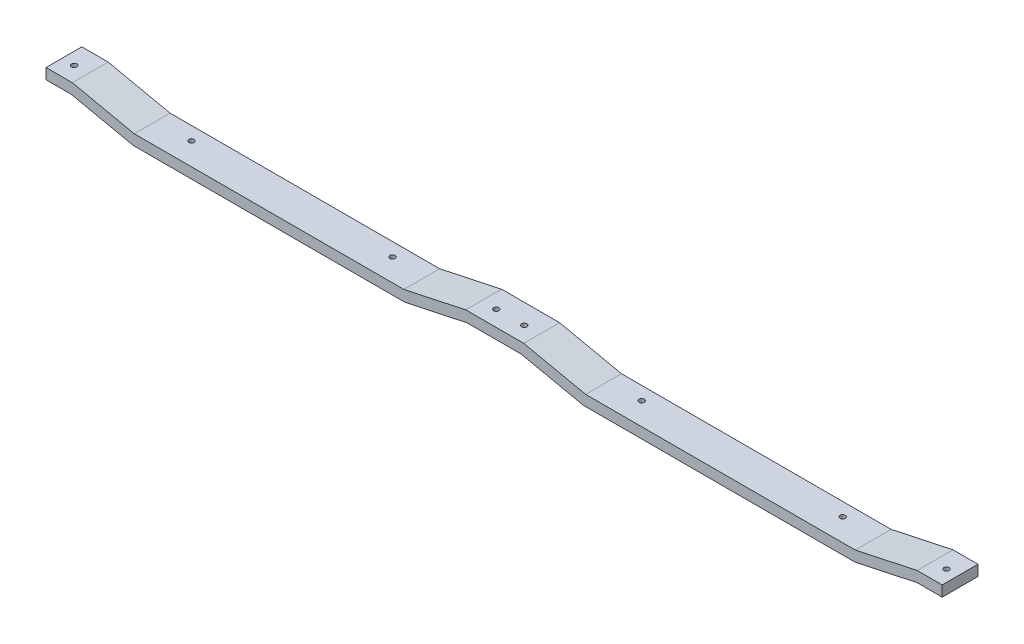
ISO-10303-21;
HEADER;
FILE_DESCRIPTION(('STEP AP214'),'2;1');
FILE_NAME('part.step','',(''),(''),'','','');
FILE_SCHEMA(('AUTOMOTIVE_DESIGN { 1 0 10303 214 1 1 1 1 }'));
ENDSEC;
DATA;
#1=APPLICATION_CONTEXT('core data for automotive mechanical design processes');
#2=APPLICATION_PROTOCOL_DEFINITION('international standard','automotive_design',2000,#1);
#3=PRODUCT_CONTEXT('',#1,'mechanical');
#4=PRODUCT('Part','Part','',(#3));
#5=PRODUCT_RELATED_PRODUCT_CATEGORY('part','',(#4));
#6=PRODUCT_DEFINITION_FORMATION('','',#4);
#7=PRODUCT_DEFINITION_CONTEXT('part definition',#1,'design');
#8=PRODUCT_DEFINITION('design','',#6,#7);
#9=PRODUCT_DEFINITION_SHAPE('','',#8);
#10=(LENGTH_UNIT() NAMED_UNIT(*) SI_UNIT(.MILLI.,.METRE.));
#11=(NAMED_UNIT(*) PLANE_ANGLE_UNIT() SI_UNIT($,.RADIAN.));
#12=(NAMED_UNIT(*) SI_UNIT($,.STERADIAN.) SOLID_ANGLE_UNIT());
#13=UNCERTAINTY_MEASURE_WITH_UNIT(LENGTH_MEASURE(1.E-05),#10,'distance_accuracy_value','');
#14=(GEOMETRIC_REPRESENTATION_CONTEXT(3) GLOBAL_UNCERTAINTY_ASSIGNED_CONTEXT((#13)) GLOBAL_UNIT_ASSIGNED_CONTEXT((#10,
#11,#12)) REPRESENTATION_CONTEXT('',''));
#15=CARTESIAN_POINT('',(0.,0.,0.));
#16=DIRECTION('',(0.,0.,1.));
#17=DIRECTION('',(1.,0.,0.));
#18=AXIS2_PLACEMENT_3D('',#15,#16,#17);
#19=CARTESIAN_POINT('',(-42.05,2.25,6.75));
#20=DIRECTION('',(1.,0.,0.));
#21=DIRECTION('',(0.,0.,-1.));
#22=AXIS2_PLACEMENT_3D('',#19,#20,#21);
#23=PLANE('',#22);
#24=DIRECTION('',(0.,-1.,0.));
#25=VECTOR('',#24,1.);
#26=CARTESIAN_POINT('',(-42.05,2.25,0.));
#27=LINE('',#26,#25);
#28=CARTESIAN_POINT('',(-42.05,2.25,0.));
#29=VERTEX_POINT('',#28);
#30=CARTESIAN_POINT('',(-42.05,0.25,0.));
#31=VERTEX_POINT('',#30);
#32=EDGE_CURVE('E202',#29,#31,#27,.T.);
#33=ORIENTED_EDGE('',*,*,#32,.T.);
#34=DIRECTION('',(0.,0.,-1.));
#35=VECTOR('',#34,1.);
#36=CARTESIAN_POINT('',(-42.05,0.25,6.75));
#37=LINE('',#36,#35);
#38=CARTESIAN_POINT('',(-42.05,0.25,6.75));
#39=VERTEX_POINT('',#38);
#40=EDGE_CURVE('E11',#39,#31,#37,.T.);
#41=ORIENTED_EDGE('',*,*,#40,.F.);
#42=DIRECTION('',(0.,-1.,0.));
#43=VECTOR('',#42,1.);
#44=CARTESIAN_POINT('',(-42.05,2.25,6.75));
#45=LINE('',#44,#43);
#46=CARTESIAN_POINT('',(-42.05,2.25,6.75));
#47=VERTEX_POINT('',#46);
#48=EDGE_CURVE('E252',#47,#39,#45,.T.);
#49=ORIENTED_EDGE('',*,*,#48,.F.);
#50=DIRECTION('',(0.,0.,-1.));
#51=VECTOR('',#50,1.);
#52=CARTESIAN_POINT('',(-42.05,2.25,6.75));
#53=LINE('',#52,#51);
#54=EDGE_CURVE('E198',#47,#29,#53,.T.);
#55=ORIENTED_EDGE('',*,*,#54,.T.);
#56=EDGE_LOOP('',(#33,#41,#49,#55));
#57=FACE_BOUND('',#56,.T.);
#58=ADVANCED_FACE('F33',(#57),#23,.F.);
#59=CARTESIAN_POINT('',(-42.05,0.25,6.75));
#60=DIRECTION('',(0.,1.,0.));
#61=DIRECTION('',(0.,0.,1.));
#62=AXIS2_PLACEMENT_3D('',#59,#60,#61);
#63=PLANE('',#62);
#64=CARTESIAN_POINT('',(-39.736857800849,0.25,3.7604860852329));
#65=DIRECTION('',(0.,1.,0.));
#66=DIRECTION('',(0.,0.,1.));
#67=AXIS2_PLACEMENT_3D('',#64,#65,#66);
#68=CIRCLE('',#67,0.499999999999999);
#69=CARTESIAN_POINT('',(-39.736857800849,0.25,4.2604860852329));
#70=VERTEX_POINT('',#69);
#71=EDGE_CURVE('E324',#70,#70,#68,.T.);
#72=ORIENTED_EDGE('',*,*,#71,.T.);
#73=EDGE_LOOP('',(#72));
#74=FACE_BOUND('',#73,.T.);
#75=DIRECTION('',(1.,0.,0.));
#76=VECTOR('',#75,1.);
#77=CARTESIAN_POINT('',(-42.05,0.25,0.));
#78=LINE('',#77,#76);
#79=CARTESIAN_POINT('',(-37.2967347571378,0.25,0.));
#80=VERTEX_POINT('',#79);
#81=EDGE_CURVE('E205',#31,#80,#78,.T.);
#82=ORIENTED_EDGE('',*,*,#81,.T.);
#83=DIRECTION('',(0.,0.,-1.));
#84=VECTOR('',#83,1.);
#85=CARTESIAN_POINT('',(-37.2967347571378,0.25,6.75));
#86=LINE('',#85,#84);
#87=CARTESIAN_POINT('',(-37.2967347571378,0.25,6.75));
#88=VERTEX_POINT('',#87);
#89=EDGE_CURVE('E42',#88,#80,#86,.T.);
#90=ORIENTED_EDGE('',*,*,#89,.F.);
#91=DIRECTION('',(1.,0.,0.));
#92=VECTOR('',#91,1.);
#93=CARTESIAN_POINT('',(-42.05,0.25,6.75));
#94=LINE('',#93,#92);
#95=EDGE_CURVE('E130',#39,#88,#94,.T.);
#96=ORIENTED_EDGE('',*,*,#95,.F.);
#97=ORIENTED_EDGE('',*,*,#40,.T.);
#98=EDGE_LOOP('',(#82,#90,#96,#97));
#99=FACE_BOUND('',#98,.T.);
#100=ADVANCED_FACE('F394',(#74,#99),#63,.F.);
#101=CARTESIAN_POINT('',(-37.2967347571378,0.25,6.75));
#102=DIRECTION('',(0.209363370555913,0.977837910427627,0.));
#103=DIRECTION('',(-0.977837910427627,0.209363370555913,0.));
#104=AXIS2_PLACEMENT_3D('',#101,#102,#103);
#105=PLANE('',#104);
#106=DIRECTION('',(0.977837910427627,-0.209363370555913,0.));
#107=VECTOR('',#106,1.);
#108=CARTESIAN_POINT('',(-37.2967347571378,0.25,0.));
#109=LINE('',#108,#107);
#110=CARTESIAN_POINT('',(-25.62040966943,-2.25,0.));
#111=VERTEX_POINT('',#110);
#112=EDGE_CURVE('E208',#80,#111,#109,.T.);
#113=ORIENTED_EDGE('',*,*,#112,.T.);
#114=DIRECTION('',(0.,0.,-1.));
#115=VECTOR('',#114,1.);
#116=CARTESIAN_POINT('',(-25.62040966943,-2.25,6.75));
#117=LINE('',#116,#115);
#118=CARTESIAN_POINT('',(-25.62040966943,-2.25,6.75));
#119=VERTEX_POINT('',#118);
#120=EDGE_CURVE('E285',#119,#111,#117,.T.);
#121=ORIENTED_EDGE('',*,*,#120,.F.);
#122=DIRECTION('',(0.977837910427627,-0.209363370555913,0.));
#123=VECTOR('',#122,1.);
#124=CARTESIAN_POINT('',(-37.2967347571378,0.25,6.75));
#125=LINE('',#124,#123);
#126=EDGE_CURVE('E334',#88,#119,#125,.T.);
#127=ORIENTED_EDGE('',*,*,#126,.F.);
#128=ORIENTED_EDGE('',*,*,#89,.T.);
#129=EDGE_LOOP('',(#113,#121,#127,#128));
#130=FACE_BOUND('',#129,.T.);
#131=ADVANCED_FACE('F398',(#130),#105,.F.);
#132=CARTESIAN_POINT('',(-25.62040966943,-2.25,6.75));
#133=DIRECTION('',(0.,1.,0.));
#134=DIRECTION('',(0.,0.,1.));
#135=AXIS2_PLACEMENT_3D('',#132,#133,#134);
#136=PLANE('',#135);
#137=CARTESIAN_POINT('',(-18.8564316077113,-2.25,2.51469630167856));
#138=DIRECTION('',(0.,1.,0.));
#139=DIRECTION('',(0.,0.,1.));
#140=AXIS2_PLACEMENT_3D('',#137,#138,#139);
#141=CIRCLE('',#140,0.499999999999999);
#142=CARTESIAN_POINT('',(-18.8564316077113,-2.25,3.01469630167856));
#143=VERTEX_POINT('',#142);
#144=EDGE_CURVE('E300',#143,#143,#141,.T.);
#145=ORIENTED_EDGE('',*,*,#144,.T.);
#146=EDGE_LOOP('',(#145));
#147=FACE_BOUND('',#146,.T.);
#148=CARTESIAN_POINT('',(19.0389710433223,-2.25,2.51469630167856));
#149=DIRECTION('',(0.,1.,0.));
#150=DIRECTION('',(0.,0.,1.));
#151=AXIS2_PLACEMENT_3D('',#148,#149,#150);
#152=CIRCLE('',#151,0.499999999999999);
#153=CARTESIAN_POINT('',(19.0389710433223,-2.25,3.01469630167856));
#154=VERTEX_POINT('',#153);
#155=EDGE_CURVE('E294',#154,#154,#152,.T.);
#156=ORIENTED_EDGE('',*,*,#155,.T.);
#157=EDGE_LOOP('',(#156));
#158=FACE_BOUND('',#157,.T.);
#159=DIRECTION('',(1.,0.,0.));
#160=VECTOR('',#159,1.);
#161=CARTESIAN_POINT('',(-25.62040966943,-2.25,0.));
#162=LINE('',#161,#160);
#163=CARTESIAN_POINT('',(25.6202332590221,-2.25,0.));
#164=VERTEX_POINT('',#163);
#165=EDGE_CURVE('E210',#111,#164,#162,.T.);
#166=ORIENTED_EDGE('',*,*,#165,.T.);
#167=DIRECTION('',(0.,0.,-1.));
#168=VECTOR('',#167,1.);
#169=CARTESIAN_POINT('',(25.6202332590221,-2.25,6.75));
#170=LINE('',#169,#168);
#171=CARTESIAN_POINT('',(25.6202332590221,-2.25,6.75));
#172=VERTEX_POINT('',#171);
#173=EDGE_CURVE('E282',#172,#164,#170,.T.);
#174=ORIENTED_EDGE('',*,*,#173,.F.);
#175=DIRECTION('',(1.,0.,0.));
#176=VECTOR('',#175,1.);
#177=CARTESIAN_POINT('',(-25.62040966943,-2.25,6.75));
#178=LINE('',#177,#176);
#179=EDGE_CURVE('E336',#119,#172,#178,.T.);
#180=ORIENTED_EDGE('',*,*,#179,.F.);
#181=ORIENTED_EDGE('',*,*,#120,.T.);
#182=EDGE_LOOP('',(#166,#174,#180,#181));
#183=FACE_BOUND('',#182,.T.);
#184=ADVANCED_FACE('F403',(#147,#158,#183),#136,.F.);
#185=CARTESIAN_POINT('',(25.6202332590221,-2.25,6.75));
#186=DIRECTION('',(-0.209360346116836,0.977838557980733,0.));
#187=DIRECTION('',(-0.977838557980733,-0.209360346116836,0.));
#188=AXIS2_PLACEMENT_3D('',#185,#186,#187);
#189=PLANE('',#188);
#190=DIRECTION('',(0.977838557980733,0.209360346116836,0.));
#191=VECTOR('',#190,1.);
#192=CARTESIAN_POINT('',(25.6202332590221,-2.25,0.));
#193=LINE('',#192,#191);
#194=CARTESIAN_POINT('',(37.2967347565292,0.25,0.));
#195=VERTEX_POINT('',#194);
#196=EDGE_CURVE('E212',#164,#195,#193,.T.);
#197=ORIENTED_EDGE('',*,*,#196,.T.);
#198=DIRECTION('',(0.,0.,-1.));
#199=VECTOR('',#198,1.);
#200=CARTESIAN_POINT('',(37.2967347565292,0.25,6.75));
#201=LINE('',#200,#199);
#202=CARTESIAN_POINT('',(37.2967347565292,0.25,6.75));
#203=VERTEX_POINT('',#202);
#204=EDGE_CURVE('E279',#203,#195,#201,.T.);
#205=ORIENTED_EDGE('',*,*,#204,.F.);
#206=DIRECTION('',(0.977838557980733,0.209360346116836,0.));
#207=VECTOR('',#206,1.);
#208=CARTESIAN_POINT('',(25.6202332590221,-2.25,6.75));
#209=LINE('',#208,#207);
#210=EDGE_CURVE('E338',#172,#203,#209,.T.);
#211=ORIENTED_EDGE('',*,*,#210,.F.);
#212=ORIENTED_EDGE('',*,*,#173,.T.);
#213=EDGE_LOOP('',(#197,#205,#211,#212));
#214=FACE_BOUND('',#213,.T.);
#215=ADVANCED_FACE('F409',(#214),#189,.F.);
#216=CARTESIAN_POINT('',(37.2967347565292,0.25,6.75));
#217=DIRECTION('',(0.,1.,0.));
#218=DIRECTION('',(-1.,0.,0.));
#219=AXIS2_PLACEMENT_3D('',#216,#217,#218);
#220=PLANE('',#219);
#221=CARTESIAN_POINT('',(45.1131421991509,0.250000000000001,3.7604860852329));
#222=DIRECTION('',(0.,1.,0.));
#223=DIRECTION('',(-1.,0.,0.));
#224=AXIS2_PLACEMENT_3D('',#221,#222,#223);
#225=CIRCLE('',#224,0.499999999999999);
#226=CARTESIAN_POINT('',(44.6131421991509,0.250000000000001,3.7604860852329));
#227=VERTEX_POINT('',#226);
#228=EDGE_CURVE('E318',#227,#227,#225,.T.);
#229=ORIENTED_EDGE('',*,*,#228,.T.);
#230=EDGE_LOOP('',(#229));
#231=FACE_BOUND('',#230,.T.);
#232=CARTESIAN_POINT('',(39.8631421991509,0.250000000000001,3.7604860852329));
#233=DIRECTION('',(0.,1.,0.));
#234=DIRECTION('',(-1.,0.,0.));
#235=AXIS2_PLACEMENT_3D('',#232,#233,#234);
#236=CIRCLE('',#235,0.499999999999999);
#237=CARTESIAN_POINT('',(39.3631421991509,0.250000000000001,3.7604860852329));
#238=VERTEX_POINT('',#237);
#239=EDGE_CURVE('E206',#238,#238,#236,.T.);
#240=ORIENTED_EDGE('',*,*,#239,.T.);
#241=EDGE_LOOP('',(#240));
#242=FACE_BOUND('',#241,.T.);
#243=DIRECTION('',(1.,0.,0.));
#244=VECTOR('',#243,1.);
#245=CARTESIAN_POINT('',(37.2967347565292,0.25,0.));
#246=LINE('',#245,#244);
#247=CARTESIAN_POINT('',(47.5467347565292,0.250000000000001,0.));
#248=VERTEX_POINT('',#247);
#249=EDGE_CURVE('E214',#195,#248,#246,.T.);
#250=ORIENTED_EDGE('',*,*,#249,.T.);
#251=DIRECTION('',(0.,0.,-1.));
#252=VECTOR('',#251,1.);
#253=CARTESIAN_POINT('',(47.5467347565292,0.250000000000001,6.75));
#254=LINE('',#253,#252);
#255=CARTESIAN_POINT('',(47.5467347565292,0.250000000000001,6.75));
#256=VERTEX_POINT('',#255);
#257=EDGE_CURVE('E277',#256,#248,#254,.T.);
#258=ORIENTED_EDGE('',*,*,#257,.F.);
#259=DIRECTION('',(1.,0.,0.));
#260=VECTOR('',#259,1.);
#261=CARTESIAN_POINT('',(37.2967347565292,0.25,6.75));
#262=LINE('',#261,#260);
#263=EDGE_CURVE('E340',#203,#256,#262,.T.);
#264=ORIENTED_EDGE('',*,*,#263,.F.);
#265=ORIENTED_EDGE('',*,*,#204,.T.);
#266=EDGE_LOOP('',(#250,#258,#264,#265));
#267=FACE_BOUND('',#266,.T.);
#268=ADVANCED_FACE('F412',(#231,#242,#267),#220,.F.);
#269=CARTESIAN_POINT('',(59.2232362540363,-2.25,6.75));
#270=DIRECTION('',(-0.209360346116835,-0.977838557980733,0.));
#271=DIRECTION('',(0.977838557980733,-0.209360346116835,0.));
#272=AXIS2_PLACEMENT_3D('',#269,#270,#271);
#273=PLANE('',#272);
#274=DIRECTION('',(-0.977838557980733,0.209360346116835,0.));
#275=VECTOR('',#274,1.);
#276=CARTESIAN_POINT('',(59.2232362540363,-2.25,0.));
#277=LINE('',#276,#275);
#278=CARTESIAN_POINT('',(59.2232362540363,-2.25,0.));
#279=VERTEX_POINT('',#278);
#280=EDGE_CURVE('E217',#279,#248,#277,.T.);
#281=ORIENTED_EDGE('',*,*,#280,.F.);
#282=DIRECTION('',(0.,0.,-1.));
#283=VECTOR('',#282,1.);
#284=CARTESIAN_POINT('',(59.2232362540363,-2.25,6.75));
#285=LINE('',#284,#283);
#286=CARTESIAN_POINT('',(59.2232362540363,-2.25,6.75));
#287=VERTEX_POINT('',#286);
#288=EDGE_CURVE('E275',#287,#279,#285,.T.);
#289=ORIENTED_EDGE('',*,*,#288,.F.);
#290=DIRECTION('',(-0.977838557980733,0.209360346116835,0.));
#291=VECTOR('',#290,1.);
#292=CARTESIAN_POINT('',(59.2232362540363,-2.25,6.75));
#293=LINE('',#292,#291);
#294=EDGE_CURVE('E342',#287,#256,#293,.T.);
#295=ORIENTED_EDGE('',*,*,#294,.T.);
#296=ORIENTED_EDGE('',*,*,#257,.T.);
#297=EDGE_LOOP('',(#281,#289,#295,#296));
#298=FACE_BOUND('',#297,.T.);
#299=ADVANCED_FACE('F416',(#298),#273,.T.);
#300=CARTESIAN_POINT('',(110.463879182488,-2.24999999999999,6.75));
#301=DIRECTION('',(0.,-1.,0.));
#302=DIRECTION('',(1.,0.,0.));
#303=AXIS2_PLACEMENT_3D('',#300,#301,#302);
#304=PLANE('',#303);
#305=CARTESIAN_POINT('',(103.888971043322,-2.25,2.51469630167856));
#306=DIRECTION('',(0.,1.,0.));
#307=DIRECTION('',(0.,0.,1.));
#308=AXIS2_PLACEMENT_3D('',#305,#306,#307);
#309=CIRCLE('',#308,0.499999999999999);
#310=CARTESIAN_POINT('',(103.888971043322,-2.25,3.01469630167856));
#311=VERTEX_POINT('',#310);
#312=EDGE_CURVE('E310',#311,#311,#309,.T.);
#313=ORIENTED_EDGE('',*,*,#312,.T.);
#314=EDGE_LOOP('',(#313));
#315=FACE_BOUND('',#314,.T.);
#316=CARTESIAN_POINT('',(65.9935683922887,-2.25,2.51469630167856));
#317=DIRECTION('',(0.,1.,0.));
#318=DIRECTION('',(0.,0.,1.));
#319=AXIS2_PLACEMENT_3D('',#316,#317,#318);
#320=CIRCLE('',#319,0.499999999999999);
#321=CARTESIAN_POINT('',(65.9935683922887,-2.25,3.01469630167856));
#322=VERTEX_POINT('',#321);
#323=EDGE_CURVE('E297',#322,#322,#320,.T.);
#324=ORIENTED_EDGE('',*,*,#323,.T.);
#325=EDGE_LOOP('',(#324));
#326=FACE_BOUND('',#325,.T.);
#327=DIRECTION('',(-1.,0.,0.));
#328=VECTOR('',#327,1.);
#329=CARTESIAN_POINT('',(110.463879182488,-2.24999999999999,0.));
#330=LINE('',#329,#328);
#331=CARTESIAN_POINT('',(110.463879182488,-2.24999999999999,0.));
#332=VERTEX_POINT('',#331);
#333=EDGE_CURVE('E220',#332,#279,#330,.T.);
#334=ORIENTED_EDGE('',*,*,#333,.F.);
#335=DIRECTION('',(0.,0.,-1.));
#336=VECTOR('',#335,1.);
#337=CARTESIAN_POINT('',(110.463879182488,-2.24999999999999,6.75));
#338=LINE('',#337,#336);
#339=CARTESIAN_POINT('',(110.463879182488,-2.24999999999999,6.75));
#340=VERTEX_POINT('',#339);
#341=EDGE_CURVE('E273',#340,#332,#338,.T.);
#342=ORIENTED_EDGE('',*,*,#341,.F.);
#343=DIRECTION('',(-1.,0.,0.));
#344=VECTOR('',#343,1.);
#345=CARTESIAN_POINT('',(110.463879182488,-2.24999999999999,6.75));
#346=LINE('',#345,#344);
#347=EDGE_CURVE('E345',#340,#287,#346,.T.);
#348=ORIENTED_EDGE('',*,*,#347,.T.);
#349=ORIENTED_EDGE('',*,*,#288,.T.);
#350=EDGE_LOOP('',(#334,#342,#348,#349));
#351=FACE_BOUND('',#350,.T.);
#352=ADVANCED_FACE('F420',(#315,#326,#351),#304,.T.);
#353=CARTESIAN_POINT('',(122.140204270196,0.250000000000007,6.75));
#354=DIRECTION('',(0.209363370555913,-0.977837910427627,0.));
#355=DIRECTION('',(0.977837910427627,0.209363370555913,0.));
#356=AXIS2_PLACEMENT_3D('',#353,#354,#355);
#357=PLANE('',#356);
#358=DIRECTION('',(-0.977837910427627,-0.209363370555913,0.));
#359=VECTOR('',#358,1.);
#360=CARTESIAN_POINT('',(122.140204270196,0.250000000000007,0.));
#361=LINE('',#360,#359);
#362=CARTESIAN_POINT('',(122.140204270196,0.250000000000007,0.));
#363=VERTEX_POINT('',#362);
#364=EDGE_CURVE('E223',#363,#332,#361,.T.);
#365=ORIENTED_EDGE('',*,*,#364,.F.);
#366=DIRECTION('',(0.,0.,-1.));
#367=VECTOR('',#366,1.);
#368=CARTESIAN_POINT('',(122.140204270196,0.250000000000007,6.75));
#369=LINE('',#368,#367);
#370=CARTESIAN_POINT('',(122.140204270196,0.250000000000007,6.75));
#371=VERTEX_POINT('',#370);
#372=EDGE_CURVE('E271',#371,#363,#369,.T.);
#373=ORIENTED_EDGE('',*,*,#372,.F.);
#374=DIRECTION('',(-0.977837910427627,-0.209363370555913,0.));
#375=VECTOR('',#374,1.);
#376=CARTESIAN_POINT('',(122.140204270196,0.250000000000007,6.75));
#377=LINE('',#376,#375);
#378=EDGE_CURVE('E348',#371,#340,#377,.T.);
#379=ORIENTED_EDGE('',*,*,#378,.T.);
#380=ORIENTED_EDGE('',*,*,#341,.T.);
#381=EDGE_LOOP('',(#365,#373,#379,#380));
#382=FACE_BOUND('',#381,.T.);
#383=ADVANCED_FACE('F424',(#382),#357,.T.);
#384=CARTESIAN_POINT('',(126.893469513058,0.250000000000008,6.75));
#385=DIRECTION('',(0.,-1.,0.));
#386=DIRECTION('',(1.,0.,0.));
#387=AXIS2_PLACEMENT_3D('',#384,#385,#386);
#388=PLANE('',#387);
#389=CARTESIAN_POINT('',(124.713142199151,0.250000000000007,3.7604860852329));
#390=DIRECTION('',(0.,-1.,0.));
#391=DIRECTION('',(1.,0.,0.));
#392=AXIS2_PLACEMENT_3D('',#389,#390,#391);
#393=CIRCLE('',#392,0.499999999999999);
#394=CARTESIAN_POINT('',(125.213142199151,0.250000000000007,3.7604860852329));
#395=VERTEX_POINT('',#394);
#396=EDGE_CURVE('E552',#395,#395,#393,.T.);
#397=ORIENTED_EDGE('',*,*,#396,.F.);
#398=EDGE_LOOP('',(#397));
#399=FACE_BOUND('',#398,.T.);
#400=DIRECTION('',(-1.,0.,0.));
#401=VECTOR('',#400,1.);
#402=CARTESIAN_POINT('',(126.893469513058,0.250000000000008,0.));
#403=LINE('',#402,#401);
#404=CARTESIAN_POINT('',(126.893469513058,0.250000000000008,0.));
#405=VERTEX_POINT('',#404);
#406=EDGE_CURVE('E226',#405,#363,#403,.T.);
#407=ORIENTED_EDGE('',*,*,#406,.F.);
#408=DIRECTION('',(0.,0.,-1.));
#409=VECTOR('',#408,1.);
#410=CARTESIAN_POINT('',(126.893469513058,0.250000000000008,6.75));
#411=LINE('',#410,#409);
#412=CARTESIAN_POINT('',(126.893469513058,0.250000000000008,6.75));
#413=VERTEX_POINT('',#412);
#414=EDGE_CURVE('E269',#413,#405,#411,.T.);
#415=ORIENTED_EDGE('',*,*,#414,.F.);
#416=DIRECTION('',(-1.,0.,0.));
#417=VECTOR('',#416,1.);
#418=CARTESIAN_POINT('',(126.893469513058,0.250000000000008,6.75));
#419=LINE('',#418,#417);
#420=EDGE_CURVE('E351',#413,#371,#419,.T.);
#421=ORIENTED_EDGE('',*,*,#420,.T.);
#422=ORIENTED_EDGE('',*,*,#372,.T.);
#423=EDGE_LOOP('',(#407,#415,#421,#422));
#424=FACE_BOUND('',#423,.T.);
#425=ADVANCED_FACE('F428',(#399,#424),#388,.T.);
#426=CARTESIAN_POINT('',(126.893469513058,2.25000000000001,6.75));
#427=DIRECTION('',(1.,0.,0.));
#428=DIRECTION('',(0.,0.,-1.));
#429=AXIS2_PLACEMENT_3D('',#426,#427,#428);
#430=PLANE('',#429);
#431=DIRECTION('',(0.,-1.,0.));
#432=VECTOR('',#431,1.);
#433=CARTESIAN_POINT('',(126.893469513058,2.25000000000001,0.));
#434=LINE('',#433,#432);
#435=CARTESIAN_POINT('',(126.893469513058,2.25000000000001,0.));
#436=VERTEX_POINT('',#435);
#437=EDGE_CURVE('E229',#436,#405,#434,.T.);
#438=ORIENTED_EDGE('',*,*,#437,.F.);
#439=DIRECTION('',(0.,0.,-1.));
#440=VECTOR('',#439,1.);
#441=CARTESIAN_POINT('',(126.893469513058,2.25000000000001,6.75));
#442=LINE('',#441,#440);
#443=CARTESIAN_POINT('',(126.893469513058,2.25000000000001,6.75));
#444=VERTEX_POINT('',#443);
#445=EDGE_CURVE('E267',#444,#436,#442,.T.);
#446=ORIENTED_EDGE('',*,*,#445,.F.);
#447=DIRECTION('',(0.,-1.,0.));
#448=VECTOR('',#447,1.);
#449=CARTESIAN_POINT('',(126.893469513058,2.25000000000001,6.75));
#450=LINE('',#449,#448);
#451=EDGE_CURVE('E354',#444,#413,#450,.T.);
#452=ORIENTED_EDGE('',*,*,#451,.T.);
#453=ORIENTED_EDGE('',*,*,#414,.T.);
#454=EDGE_LOOP('',(#438,#446,#452,#453));
#455=FACE_BOUND('',#454,.T.);
#456=ADVANCED_FACE('F432',(#455),#430,.T.);
#457=CARTESIAN_POINT('',(122.17849493906,2.25000000000001,6.75));
#458=DIRECTION('',(0.,1.,0.));
#459=DIRECTION('',(-1.,0.,0.));
#460=AXIS2_PLACEMENT_3D('',#457,#458,#459);
#461=PLANE('',#460);
#462=CARTESIAN_POINT('',(124.713142199151,2.25000000000001,3.7604860852329));
#463=DIRECTION('',(0.,1.,0.));
#464=DIRECTION('',(0.,0.,1.));
#465=AXIS2_PLACEMENT_3D('',#462,#463,#464);
#466=CIRCLE('',#465,0.499999999999999);
#467=CARTESIAN_POINT('',(124.713142199151,2.25000000000001,4.2604860852329));
#468=VERTEX_POINT('',#467);
#469=EDGE_CURVE('E555',#468,#468,#466,.T.);
#470=ORIENTED_EDGE('',*,*,#469,.F.);
#471=EDGE_LOOP('',(#470));
#472=FACE_BOUND('',#471,.T.);
#473=DIRECTION('',(1.,0.,0.));
#474=VECTOR('',#473,1.);
#475=CARTESIAN_POINT('',(122.17849493906,2.25000000000001,0.));
#476=LINE('',#475,#474);
#477=CARTESIAN_POINT('',(122.17849493906,2.25000000000001,0.));
#478=VERTEX_POINT('',#477);
#479=EDGE_CURVE('E232',#478,#436,#476,.T.);
#480=ORIENTED_EDGE('',*,*,#479,.F.);
#481=DIRECTION('',(0.,0.,-1.));
#482=VECTOR('',#481,1.);
#483=CARTESIAN_POINT('',(122.17849493906,2.25000000000001,6.75));
#484=LINE('',#483,#482);
#485=CARTESIAN_POINT('',(122.17849493906,2.25000000000001,6.75));
#486=VERTEX_POINT('',#485);
#487=EDGE_CURVE('E265',#486,#478,#484,.T.);
#488=ORIENTED_EDGE('',*,*,#487,.F.);
#489=DIRECTION('',(1.,0.,0.));
#490=VECTOR('',#489,1.);
#491=CARTESIAN_POINT('',(122.17849493906,2.25000000000001,6.75));
#492=LINE('',#491,#490);
#493=EDGE_CURVE('E357',#486,#444,#492,.T.);
#494=ORIENTED_EDGE('',*,*,#493,.T.);
#495=ORIENTED_EDGE('',*,*,#445,.T.);
#496=EDGE_LOOP('',(#480,#488,#494,#495));
#497=FACE_BOUND('',#496,.T.);
#498=ADVANCED_FACE('F436',(#472,#497),#461,.T.);
#499=CARTESIAN_POINT('',(110.502169851353,-0.249999999999992,6.75));
#500=DIRECTION('',(-0.209363370555913,0.977837910427627,0.));
#501=DIRECTION('',(-0.977837910427627,-0.209363370555913,0.));
#502=AXIS2_PLACEMENT_3D('',#499,#500,#501);
#503=PLANE('',#502);
#504=DIRECTION('',(0.977837910427627,0.209363370555913,0.));
#505=VECTOR('',#504,1.);
#506=CARTESIAN_POINT('',(110.502169851353,-0.249999999999992,0.));
#507=LINE('',#506,#505);
#508=CARTESIAN_POINT('',(110.502169851353,-0.249999999999992,0.));
#509=VERTEX_POINT('',#508);
#510=EDGE_CURVE('E235',#509,#478,#507,.T.);
#511=ORIENTED_EDGE('',*,*,#510,.F.);
#512=DIRECTION('',(0.,0.,-1.));
#513=VECTOR('',#512,1.);
#514=CARTESIAN_POINT('',(110.502169851353,-0.249999999999992,6.75));
#515=LINE('',#514,#513);
#516=CARTESIAN_POINT('',(110.502169851353,-0.249999999999992,6.75));
#517=VERTEX_POINT('',#516);
#518=EDGE_CURVE('E263',#517,#509,#515,.T.);
#519=ORIENTED_EDGE('',*,*,#518,.F.);
#520=DIRECTION('',(0.977837910427627,0.209363370555913,0.));
#521=VECTOR('',#520,1.);
#522=CARTESIAN_POINT('',(110.502169851353,-0.249999999999992,6.75));
#523=LINE('',#522,#521);
#524=EDGE_CURVE('E360',#517,#486,#523,.T.);
#525=ORIENTED_EDGE('',*,*,#524,.T.);
#526=ORIENTED_EDGE('',*,*,#487,.T.);
#527=EDGE_LOOP('',(#511,#519,#525,#526));
#528=FACE_BOUND('',#527,.T.);
#529=ADVANCED_FACE('F440',(#528),#503,.T.);
#530=CARTESIAN_POINT('',(59.6849424575301,-0.249999999999998,6.75));
#531=DIRECTION('',(0.,1.,0.));
#532=DIRECTION('',(-1.,0.,0.));
#533=AXIS2_PLACEMENT_3D('',#530,#531,#532);
#534=PLANE('',#533);
#535=CARTESIAN_POINT('',(103.888971043322,-0.249999999999992,2.51469630167856));
#536=DIRECTION('',(0.,1.,0.));
#537=DIRECTION('',(-1.,0.,0.));
#538=AXIS2_PLACEMENT_3D('',#535,#536,#537);
#539=CIRCLE('',#538,0.499999999999999);
#540=CARTESIAN_POINT('',(103.388971043322,-0.249999999999992,2.51469630167856));
#541=VERTEX_POINT('',#540);
#542=EDGE_CURVE('E36',#541,#541,#539,.T.);
#543=ORIENTED_EDGE('',*,*,#542,.F.);
#544=EDGE_LOOP('',(#543));
#545=FACE_BOUND('',#544,.T.);
#546=CARTESIAN_POINT('',(65.9935683922887,-0.249999999999997,2.51469630167856));
#547=DIRECTION('',(0.,1.,0.));
#548=DIRECTION('',(-1.,0.,0.));
#549=AXIS2_PLACEMENT_3D('',#546,#547,#548);
#550=CIRCLE('',#549,0.499999999999999);
#551=CARTESIAN_POINT('',(65.4935683922887,-0.249999999999997,2.51469630167856));
#552=VERTEX_POINT('',#551);
#553=EDGE_CURVE('E295',#552,#552,#550,.T.);
#554=ORIENTED_EDGE('',*,*,#553,.F.);
#555=EDGE_LOOP('',(#554));
#556=FACE_BOUND('',#555,.T.);
#557=DIRECTION('',(1.,0.,0.));
#558=VECTOR('',#557,1.);
#559=CARTESIAN_POINT('',(59.6849424575301,-0.249999999999998,0.));
#560=LINE('',#559,#558);
#561=CARTESIAN_POINT('',(59.6849424575301,-0.249999999999998,0.));
#562=VERTEX_POINT('',#561);
#563=EDGE_CURVE('E238',#562,#509,#560,.T.);
#564=ORIENTED_EDGE('',*,*,#563,.F.);
#565=DIRECTION('',(0.,0.,-1.));
#566=VECTOR('',#565,1.);
#567=CARTESIAN_POINT('',(59.6849424575301,-0.249999999999998,6.75));
#568=LINE('',#567,#566);
#569=CARTESIAN_POINT('',(59.6849424575301,-0.249999999999998,6.75));
#570=VERTEX_POINT('',#569);
#571=EDGE_CURVE('E261',#570,#562,#568,.T.);
#572=ORIENTED_EDGE('',*,*,#571,.F.);
#573=DIRECTION('',(1.,0.,0.));
#574=VECTOR('',#573,1.);
#575=CARTESIAN_POINT('',(59.6849424575301,-0.249999999999998,6.75));
#576=LINE('',#575,#574);
#577=EDGE_CURVE('E363',#570,#517,#576,.T.);
#578=ORIENTED_EDGE('',*,*,#577,.T.);
#579=ORIENTED_EDGE('',*,*,#518,.T.);
#580=EDGE_LOOP('',(#564,#572,#578,#579));
#581=FACE_BOUND('',#580,.T.);
#582=ADVANCED_FACE('F444',(#545,#556,#581),#534,.T.);
#583=CARTESIAN_POINT('',(59.6849424575301,-0.249999999999998,6.75));
#584=DIRECTION('',(-0.209360346116835,-0.977838557980733,0.));
#585=DIRECTION('',(0.977838557980733,-0.209360346116835,0.));
#586=AXIS2_PLACEMENT_3D('',#583,#584,#585);
#587=PLANE('',#586);
#588=DIRECTION('',(-0.977838557980733,0.209360346116835,0.));
#589=VECTOR('',#588,1.);
#590=CARTESIAN_POINT('',(59.6849424575301,-0.249999999999998,0.));
#591=LINE('',#590,#589);
#592=CARTESIAN_POINT('',(48.008440960023,2.25,0.));
#593=VERTEX_POINT('',#592);
#594=EDGE_CURVE('E241',#562,#593,#591,.T.);
#595=ORIENTED_EDGE('',*,*,#594,.T.);
#596=DIRECTION('',(0.,0.,-1.));
#597=VECTOR('',#596,1.);
#598=CARTESIAN_POINT('',(48.008440960023,2.25,6.75));
#599=LINE('',#598,#597);
#600=CARTESIAN_POINT('',(48.008440960023,2.25,6.75));
#601=VERTEX_POINT('',#600);
#602=EDGE_CURVE('E258',#601,#593,#599,.T.);
#603=ORIENTED_EDGE('',*,*,#602,.F.);
#604=DIRECTION('',(-0.977838557980733,0.209360346116835,0.));
#605=VECTOR('',#604,1.);
#606=CARTESIAN_POINT('',(59.6849424575301,-0.249999999999998,6.75));
#607=LINE('',#606,#605);
#608=EDGE_CURVE('E366',#570,#601,#607,.T.);
#609=ORIENTED_EDGE('',*,*,#608,.F.);
#610=ORIENTED_EDGE('',*,*,#571,.T.);
#611=EDGE_LOOP('',(#595,#603,#609,#610));
#612=FACE_BOUND('',#611,.T.);
#613=ADVANCED_FACE('F448',(#612),#587,.F.);
#614=CARTESIAN_POINT('',(48.008440960023,2.25,6.75));
#615=DIRECTION('',(0.,-1.,0.));
#616=DIRECTION('',(1.,0.,0.));
#617=AXIS2_PLACEMENT_3D('',#614,#615,#616);
#618=PLANE('',#617);
#619=CARTESIAN_POINT('',(45.1131421991509,2.25000000000001,3.7604860852329));
#620=DIRECTION('',(0.,1.,0.));
#621=DIRECTION('',(0.,0.,1.));
#622=AXIS2_PLACEMENT_3D('',#619,#620,#621);
#623=CIRCLE('',#622,0.499999999999999);
#624=CARTESIAN_POINT('',(45.1131421991509,2.25000000000001,4.2604860852329));
#625=VERTEX_POINT('',#624);
#626=EDGE_CURVE('E293',#625,#625,#623,.T.);
#627=ORIENTED_EDGE('',*,*,#626,.F.);
#628=EDGE_LOOP('',(#627));
#629=FACE_BOUND('',#628,.T.);
#630=CARTESIAN_POINT('',(39.8631421991509,2.25000000000001,3.7604860852329));
#631=DIRECTION('',(0.,1.,0.));
#632=DIRECTION('',(0.,0.,1.));
#633=AXIS2_PLACEMENT_3D('',#630,#631,#632);
#634=CIRCLE('',#633,0.499999999999999);
#635=CARTESIAN_POINT('',(39.8631421991509,2.25000000000001,4.2604860852329));
#636=VERTEX_POINT('',#635);
#637=EDGE_CURVE('E327',#636,#636,#634,.T.);
#638=ORIENTED_EDGE('',*,*,#637,.F.);
#639=EDGE_LOOP('',(#638));
#640=FACE_BOUND('',#639,.T.);
#641=DIRECTION('',(-1.,0.,0.));
#642=VECTOR('',#641,1.);
#643=CARTESIAN_POINT('',(48.008440960023,2.25,0.));
#644=LINE('',#643,#642);
#645=CARTESIAN_POINT('',(37.0850285530354,2.25,0.));
#646=VERTEX_POINT('',#645);
#647=EDGE_CURVE('E243',#593,#646,#644,.T.);
#648=ORIENTED_EDGE('',*,*,#647,.T.);
#649=DIRECTION('',(0.,0.,-1.));
#650=VECTOR('',#649,1.);
#651=CARTESIAN_POINT('',(37.0850285530354,2.25,6.75));
#652=LINE('',#651,#650);
#653=CARTESIAN_POINT('',(37.0850285530354,2.25,6.75));
#654=VERTEX_POINT('',#653);
#655=EDGE_CURVE('E256',#654,#646,#652,.T.);
#656=ORIENTED_EDGE('',*,*,#655,.F.);
#657=DIRECTION('',(-1.,0.,0.));
#658=VECTOR('',#657,1.);
#659=CARTESIAN_POINT('',(48.008440960023,2.25,6.75));
#660=LINE('',#659,#658);
#661=EDGE_CURVE('E368',#601,#654,#660,.T.);
#662=ORIENTED_EDGE('',*,*,#661,.F.);
#663=ORIENTED_EDGE('',*,*,#602,.T.);
#664=EDGE_LOOP('',(#648,#656,#662,#663));
#665=FACE_BOUND('',#664,.T.);
#666=ADVANCED_FACE('F452',(#629,#640,#665),#618,.F.);
#667=CARTESIAN_POINT('',(25.4085270555284,-0.25,6.75));
#668=DIRECTION('',(-0.209360346116836,0.977838557980733,0.));
#669=DIRECTION('',(-0.977838557980733,-0.209360346116836,0.));
#670=AXIS2_PLACEMENT_3D('',#667,#668,#669);
#671=PLANE('',#670);
#672=DIRECTION('',(0.977838557980733,0.209360346116836,0.));
#673=VECTOR('',#672,1.);
#674=CARTESIAN_POINT('',(25.4085270555284,-0.25,0.));
#675=LINE('',#674,#673);
#676=CARTESIAN_POINT('',(25.4085270555284,-0.25,0.));
#677=VERTEX_POINT('',#676);
#678=EDGE_CURVE('E246',#677,#646,#675,.T.);
#679=ORIENTED_EDGE('',*,*,#678,.F.);
#680=DIRECTION('',(0.,0.,-1.));
#681=VECTOR('',#680,1.);
#682=CARTESIAN_POINT('',(25.4085270555284,-0.25,6.75));
#683=LINE('',#682,#681);
#684=CARTESIAN_POINT('',(25.4085270555284,-0.25,6.75));
#685=VERTEX_POINT('',#684);
#686=EDGE_CURVE('E193',#685,#677,#683,.T.);
#687=ORIENTED_EDGE('',*,*,#686,.F.);
#688=DIRECTION('',(0.977838557980733,0.209360346116836,0.));
#689=VECTOR('',#688,1.);
#690=CARTESIAN_POINT('',(25.4085270555284,-0.25,6.75));
#691=LINE('',#690,#689);
#692=EDGE_CURVE('E186',#685,#654,#691,.T.);
#693=ORIENTED_EDGE('',*,*,#692,.T.);
#694=ORIENTED_EDGE('',*,*,#655,.T.);
#695=EDGE_LOOP('',(#679,#687,#693,#694));
#696=FACE_BOUND('',#695,.T.);
#697=ADVANCED_FACE('F371',(#696),#671,.T.);
#698=CARTESIAN_POINT('',(25.4085270555284,-0.25,6.75));
#699=DIRECTION('',(0.,-1.,0.));
#700=DIRECTION('',(0.,0.,-1.));
#701=AXIS2_PLACEMENT_3D('',#698,#699,#700);
#702=PLANE('',#701);
#703=CARTESIAN_POINT('',(-18.8564316077113,-0.25,2.51469630167856));
#704=DIRECTION('',(0.,-1.,0.));
#705=DIRECTION('',(0.,0.,-1.));
#706=AXIS2_PLACEMENT_3D('',#703,#704,#705);
#707=CIRCLE('',#706,0.499999999999999);
#708=CARTESIAN_POINT('',(-18.8564316077113,-0.25,2.01469630167857));
#709=VERTEX_POINT('',#708);
#710=EDGE_CURVE('E298',#709,#709,#707,.T.);
#711=ORIENTED_EDGE('',*,*,#710,.T.);
#712=EDGE_LOOP('',(#711));
#713=FACE_BOUND('',#712,.T.);
#714=CARTESIAN_POINT('',(19.0389710433223,-0.25,2.51469630167856));
#715=DIRECTION('',(0.,-1.,0.));
#716=DIRECTION('',(0.,0.,-1.));
#717=AXIS2_PLACEMENT_3D('',#714,#715,#716);
#718=CIRCLE('',#717,0.499999999999999);
#719=CARTESIAN_POINT('',(19.0389710433223,-0.25,2.01469630167857));
#720=VERTEX_POINT('',#719);
#721=EDGE_CURVE('E290',#720,#720,#718,.T.);
#722=ORIENTED_EDGE('',*,*,#721,.T.);
#723=EDGE_LOOP('',(#722));
#724=FACE_BOUND('',#723,.T.);
#725=DIRECTION('',(-1.,0.,0.));
#726=VECTOR('',#725,1.);
#727=CARTESIAN_POINT('',(25.4085270555284,-0.25,0.));
#728=LINE('',#727,#726);
#729=CARTESIAN_POINT('',(-25.4087003382941,-0.25,0.));
#730=VERTEX_POINT('',#729);
#731=EDGE_CURVE('E192',#677,#730,#728,.T.);
#732=ORIENTED_EDGE('',*,*,#731,.T.);
#733=DIRECTION('',(0.,0.,-1.));
#734=VECTOR('',#733,1.);
#735=CARTESIAN_POINT('',(-25.4087003382941,-0.25,6.75));
#736=LINE('',#735,#734);
#737=CARTESIAN_POINT('',(-25.4087003382941,-0.25,6.75));
#738=VERTEX_POINT('',#737);
#739=EDGE_CURVE('E189',#738,#730,#736,.T.);
#740=ORIENTED_EDGE('',*,*,#739,.F.);
#741=DIRECTION('',(-1.,0.,0.));
#742=VECTOR('',#741,1.);
#743=CARTESIAN_POINT('',(25.4085270555284,-0.25,6.75));
#744=LINE('',#743,#742);
#745=EDGE_CURVE('E180',#685,#738,#744,.T.);
#746=ORIENTED_EDGE('',*,*,#745,.F.);
#747=ORIENTED_EDGE('',*,*,#686,.T.);
#748=EDGE_LOOP('',(#732,#740,#746,#747));
#749=FACE_BOUND('',#748,.T.);
#750=ADVANCED_FACE('F190',(#713,#724,#749),#702,.F.);
#751=CARTESIAN_POINT('',(-25.4087003382941,-0.25,6.75));
#752=DIRECTION('',(-0.209363370555913,-0.977837910427627,0.));
#753=DIRECTION('',(0.977837910427627,-0.209363370555913,0.));
#754=AXIS2_PLACEMENT_3D('',#751,#752,#753);
#755=PLANE('',#754);
#756=DIRECTION('',(-0.977837910427627,0.209363370555913,0.));
#757=VECTOR('',#756,1.);
#758=CARTESIAN_POINT('',(-25.4087003382941,-0.25,0.));
#759=LINE('',#758,#757);
#760=CARTESIAN_POINT('',(-37.0850254260019,2.25,0.));
#761=VERTEX_POINT('',#760);
#762=EDGE_CURVE('E116',#730,#761,#759,.T.);
#763=ORIENTED_EDGE('',*,*,#762,.T.);
#764=DIRECTION('',(0.,0.,-1.));
#765=VECTOR('',#764,1.);
#766=CARTESIAN_POINT('',(-37.0850254260019,2.25,6.75));
#767=LINE('',#766,#765);
#768=CARTESIAN_POINT('',(-37.0850254260019,2.25,6.75));
#769=VERTEX_POINT('',#768);
#770=EDGE_CURVE('E194',#769,#761,#767,.T.);
#771=ORIENTED_EDGE('',*,*,#770,.F.);
#772=DIRECTION('',(-0.977837910427627,0.209363370555913,0.));
#773=VECTOR('',#772,1.);
#774=CARTESIAN_POINT('',(-25.4087003382941,-0.25,6.75));
#775=LINE('',#774,#773);
#776=EDGE_CURVE('E184',#738,#769,#775,.T.);
#777=ORIENTED_EDGE('',*,*,#776,.F.);
#778=ORIENTED_EDGE('',*,*,#739,.T.);
#779=EDGE_LOOP('',(#763,#771,#777,#778));
#780=FACE_BOUND('',#779,.T.);
#781=ADVANCED_FACE('F196',(#780),#755,.F.);
#782=CARTESIAN_POINT('',(-37.0850254260019,2.25,6.75));
#783=DIRECTION('',(0.,-1.,0.));
#784=DIRECTION('',(0.,0.,-1.));
#785=AXIS2_PLACEMENT_3D('',#782,#783,#784);
#786=PLANE('',#785);
#787=CARTESIAN_POINT('',(-39.736857800849,2.25000000000001,3.7604860852329));
#788=DIRECTION('',(0.,1.,0.));
#789=DIRECTION('',(0.,0.,1.));
#790=AXIS2_PLACEMENT_3D('',#787,#788,#789);
#791=CIRCLE('',#790,0.499999999999999);
#792=CARTESIAN_POINT('',(-39.736857800849,2.25000000000001,4.2604860852329));
#793=VERTEX_POINT('',#792);
#794=EDGE_CURVE('E321',#793,#793,#791,.T.);
#795=ORIENTED_EDGE('',*,*,#794,.F.);
#796=EDGE_LOOP('',(#795));
#797=FACE_BOUND('',#796,.T.);
#798=DIRECTION('',(-1.,0.,0.));
#799=VECTOR('',#798,1.);
#800=CARTESIAN_POINT('',(-37.0850254260019,2.25,0.));
#801=LINE('',#800,#799);
#802=EDGE_CURVE('E122',#761,#29,#801,.T.);
#803=ORIENTED_EDGE('',*,*,#802,.T.);
#804=ORIENTED_EDGE('',*,*,#54,.F.);
#805=DIRECTION('',(-1.,0.,0.));
#806=VECTOR('',#805,1.);
#807=CARTESIAN_POINT('',(-37.0850254260019,2.25,6.75));
#808=LINE('',#807,#806);
#809=EDGE_CURVE('E51',#769,#47,#808,.T.);
#810=ORIENTED_EDGE('',*,*,#809,.F.);
#811=ORIENTED_EDGE('',*,*,#770,.T.);
#812=EDGE_LOOP('',(#803,#804,#810,#811));
#813=FACE_BOUND('',#812,.T.);
#814=ADVANCED_FACE('F381',(#797,#813),#786,.F.);
#815=CARTESIAN_POINT('',(0.,0.,6.75));
#816=DIRECTION('',(0.,0.,1.));
#817=DIRECTION('',(1.,0.,0.));
#818=AXIS2_PLACEMENT_3D('',#815,#816,#817);
#819=PLANE('',#818);
#820=ORIENTED_EDGE('',*,*,#48,.T.);
#821=ORIENTED_EDGE('',*,*,#95,.T.);
#822=ORIENTED_EDGE('',*,*,#126,.T.);
#823=ORIENTED_EDGE('',*,*,#179,.T.);
#824=ORIENTED_EDGE('',*,*,#210,.T.);
#825=ORIENTED_EDGE('',*,*,#263,.T.);
#826=ORIENTED_EDGE('',*,*,#294,.F.);
#827=ORIENTED_EDGE('',*,*,#347,.F.);
#828=ORIENTED_EDGE('',*,*,#378,.F.);
#829=ORIENTED_EDGE('',*,*,#420,.F.);
#830=ORIENTED_EDGE('',*,*,#451,.F.);
#831=ORIENTED_EDGE('',*,*,#493,.F.);
#832=ORIENTED_EDGE('',*,*,#524,.F.);
#833=ORIENTED_EDGE('',*,*,#577,.F.);
#834=ORIENTED_EDGE('',*,*,#608,.T.);
#835=ORIENTED_EDGE('',*,*,#661,.T.);
#836=ORIENTED_EDGE('',*,*,#692,.F.);
#837=ORIENTED_EDGE('',*,*,#745,.T.);
#838=ORIENTED_EDGE('',*,*,#776,.T.);
#839=ORIENTED_EDGE('',*,*,#809,.T.);
#840=EDGE_LOOP('',(#820,#821,#822,#823,#824,#825,#826,#827,#828,#829,#830,#831,#832,#833,#834,
#835,#836,#837,#838,#839));
#841=FACE_BOUND('',#840,.T.);
#842=ADVANCED_FACE('F182',(#841),#819,.T.);
#843=CARTESIAN_POINT('',(0.,0.,0.));
#844=DIRECTION('',(0.,0.,1.));
#845=DIRECTION('',(1.,0.,0.));
#846=AXIS2_PLACEMENT_3D('',#843,#844,#845);
#847=PLANE('',#846);
#848=ORIENTED_EDGE('',*,*,#32,.F.);
#849=ORIENTED_EDGE('',*,*,#802,.F.);
#850=ORIENTED_EDGE('',*,*,#762,.F.);
#851=ORIENTED_EDGE('',*,*,#731,.F.);
#852=ORIENTED_EDGE('',*,*,#678,.T.);
#853=ORIENTED_EDGE('',*,*,#647,.F.);
#854=ORIENTED_EDGE('',*,*,#594,.F.);
#855=ORIENTED_EDGE('',*,*,#563,.T.);
#856=ORIENTED_EDGE('',*,*,#510,.T.);
#857=ORIENTED_EDGE('',*,*,#479,.T.);
#858=ORIENTED_EDGE('',*,*,#437,.T.);
#859=ORIENTED_EDGE('',*,*,#406,.T.);
#860=ORIENTED_EDGE('',*,*,#364,.T.);
#861=ORIENTED_EDGE('',*,*,#333,.T.);
#862=ORIENTED_EDGE('',*,*,#280,.T.);
#863=ORIENTED_EDGE('',*,*,#249,.F.);
#864=ORIENTED_EDGE('',*,*,#196,.F.);
#865=ORIENTED_EDGE('',*,*,#165,.F.);
#866=ORIENTED_EDGE('',*,*,#112,.F.);
#867=ORIENTED_EDGE('',*,*,#81,.F.);
#868=EDGE_LOOP('',(#848,#849,#850,#851,#852,#853,#854,#855,#856,#857,#858,#859,#860,#861,#862,
#863,#864,#865,#866,#867));
#869=FACE_BOUND('',#868,.T.);
#870=ADVANCED_FACE('F375',(#869),#847,.F.);
#871=CARTESIAN_POINT('',(39.8631421991509,-2.25,3.7604860852329));
#872=DIRECTION('',(0.,1.,0.));
#873=DIRECTION('',(0.,0.,1.));
#874=AXIS2_PLACEMENT_3D('',#871,#872,#873);
#875=CYLINDRICAL_SURFACE('',#874,0.499999999999999);
#876=ORIENTED_EDGE('',*,*,#637,.T.);
#877=EDGE_LOOP('',(#876));
#878=FACE_BOUND('',#877,.T.);
#879=ORIENTED_EDGE('',*,*,#239,.F.);
#880=EDGE_LOOP('',(#879));
#881=FACE_BOUND('',#880,.T.);
#882=ADVANCED_FACE('F486',(#878,#881),#875,.F.);
#883=CARTESIAN_POINT('',(-39.736857800849,-2.25,3.7604860852329));
#884=DIRECTION('',(0.,1.,0.));
#885=DIRECTION('',(0.,0.,1.));
#886=AXIS2_PLACEMENT_3D('',#883,#884,#885);
#887=CYLINDRICAL_SURFACE('',#886,0.499999999999999);
#888=ORIENTED_EDGE('',*,*,#794,.T.);
#889=EDGE_LOOP('',(#888));
#890=FACE_BOUND('',#889,.T.);
#891=ORIENTED_EDGE('',*,*,#71,.F.);
#892=EDGE_LOOP('',(#891));
#893=FACE_BOUND('',#892,.T.);
#894=ADVANCED_FACE('F478',(#890,#893),#887,.F.);
#895=CARTESIAN_POINT('',(45.1131421991509,-2.25,3.7604860852329));
#896=DIRECTION('',(0.,1.,0.));
#897=DIRECTION('',(0.,0.,1.));
#898=AXIS2_PLACEMENT_3D('',#895,#896,#897);
#899=CYLINDRICAL_SURFACE('',#898,0.499999999999999);
#900=ORIENTED_EDGE('',*,*,#626,.T.);
#901=EDGE_LOOP('',(#900));
#902=FACE_BOUND('',#901,.T.);
#903=ORIENTED_EDGE('',*,*,#228,.F.);
#904=EDGE_LOOP('',(#903));
#905=FACE_BOUND('',#904,.T.);
#906=ADVANCED_FACE('F468',(#902,#905),#899,.F.);
#907=CARTESIAN_POINT('',(19.0389710433223,-2.25,2.51469630167856));
#908=DIRECTION('',(0.,1.,0.));
#909=DIRECTION('',(0.,0.,1.));
#910=AXIS2_PLACEMENT_3D('',#907,#908,#909);
#911=CYLINDRICAL_SURFACE('',#910,0.499999999999999);
#912=ORIENTED_EDGE('',*,*,#155,.F.);
#913=EDGE_LOOP('',(#912));
#914=FACE_BOUND('',#913,.T.);
#915=ORIENTED_EDGE('',*,*,#721,.F.);
#916=EDGE_LOOP('',(#915));
#917=FACE_BOUND('',#916,.T.);
#918=ADVANCED_FACE('F465',(#914,#917),#911,.F.);
#919=CARTESIAN_POINT('',(65.9935683922887,-2.25,2.51469630167856));
#920=DIRECTION('',(0.,1.,0.));
#921=DIRECTION('',(0.,0.,1.));
#922=AXIS2_PLACEMENT_3D('',#919,#920,#921);
#923=CYLINDRICAL_SURFACE('',#922,0.499999999999999);
#924=ORIENTED_EDGE('',*,*,#553,.T.);
#925=EDGE_LOOP('',(#924));
#926=FACE_BOUND('',#925,.T.);
#927=ORIENTED_EDGE('',*,*,#323,.F.);
#928=EDGE_LOOP('',(#927));
#929=FACE_BOUND('',#928,.T.);
#930=ADVANCED_FACE('F467',(#926,#929),#923,.F.);
#931=CARTESIAN_POINT('',(-18.8564316077113,-2.25,2.51469630167856));
#932=DIRECTION('',(0.,1.,0.));
#933=DIRECTION('',(0.,0.,1.));
#934=AXIS2_PLACEMENT_3D('',#931,#932,#933);
#935=CYLINDRICAL_SURFACE('',#934,0.499999999999999);
#936=ORIENTED_EDGE('',*,*,#144,.F.);
#937=EDGE_LOOP('',(#936));
#938=FACE_BOUND('',#937,.T.);
#939=ORIENTED_EDGE('',*,*,#710,.F.);
#940=EDGE_LOOP('',(#939));
#941=FACE_BOUND('',#940,.T.);
#942=ADVANCED_FACE('F475',(#938,#941),#935,.F.);
#943=CARTESIAN_POINT('',(103.888971043322,-2.25,2.51469630167856));
#944=DIRECTION('',(0.,1.,0.));
#945=DIRECTION('',(0.,0.,1.));
#946=AXIS2_PLACEMENT_3D('',#943,#944,#945);
#947=CYLINDRICAL_SURFACE('',#946,0.499999999999999);
#948=ORIENTED_EDGE('',*,*,#542,.T.);
#949=EDGE_LOOP('',(#948));
#950=FACE_BOUND('',#949,.T.);
#951=ORIENTED_EDGE('',*,*,#312,.F.);
#952=EDGE_LOOP('',(#951));
#953=FACE_BOUND('',#952,.T.);
#954=ADVANCED_FACE('F526',(#950,#953),#947,.F.);
#955=CARTESIAN_POINT('',(124.713142199151,-2.25,3.7604860852329));
#956=DIRECTION('',(0.,1.,0.));
#957=DIRECTION('',(0.,0.,1.));
#958=AXIS2_PLACEMENT_3D('',#955,#956,#957);
#959=CYLINDRICAL_SURFACE('',#958,0.499999999999999);
#960=ORIENTED_EDGE('',*,*,#396,.T.);
#961=EDGE_LOOP('',(#960));
#962=FACE_BOUND('',#961,.T.);
#963=ORIENTED_EDGE('',*,*,#469,.T.);
#964=EDGE_LOOP('',(#963));
#965=FACE_BOUND('',#964,.T.);
#966=ADVANCED_FACE('F535',(#962,#965),#959,.F.);
#967=CLOSED_SHELL('',(#58,#100,#131,#184,#215,#268,#299,#352,#383,#425,#456,#498,#529,#582,#613,
#666,#697,#750,#781,#814,#842,#870,#882,#894,#906,#918,#930,#942,#954,#966));
#968=MANIFOLD_SOLID_BREP('B2',#967);
#969=ADVANCED_BREP_SHAPE_REPRESENTATION('',(#18,#968),#14);
#970=SHAPE_DEFINITION_REPRESENTATION(#9,#969);
ENDSEC;
END-ISO-10303-21;
